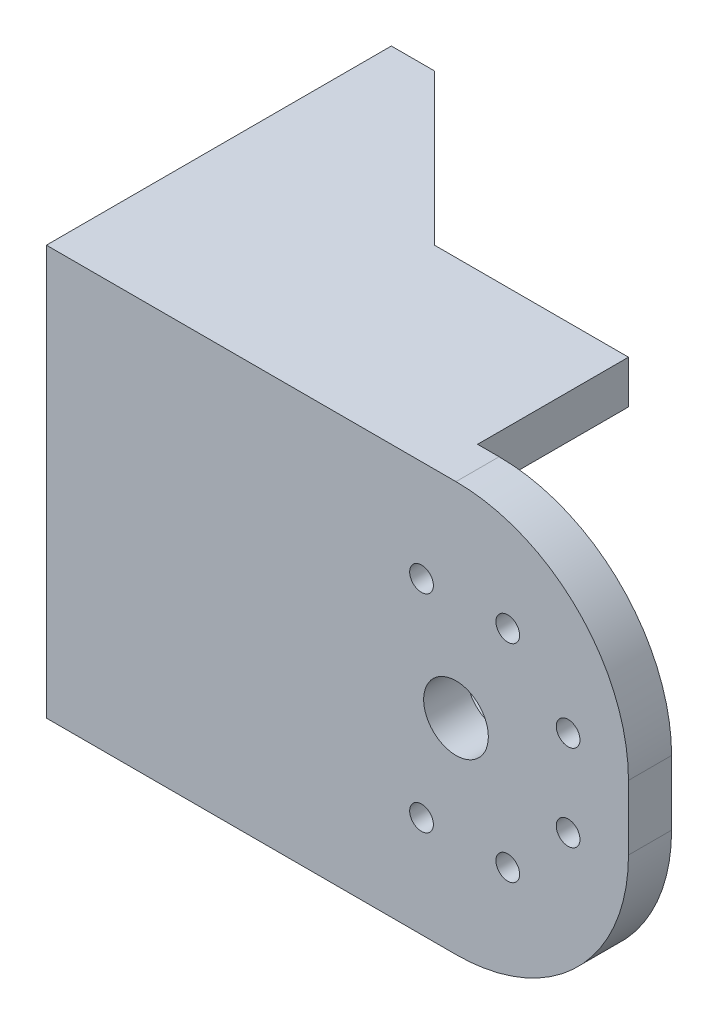
ISO-10303-21;
HEADER;
FILE_DESCRIPTION(('STEP AP214'),'2;1');
FILE_NAME('part.step','',(''),(''),'','','');
FILE_SCHEMA(('AUTOMOTIVE_DESIGN { 1 0 10303 214 1 1 1 1 }'));
ENDSEC;
DATA;
#1=APPLICATION_CONTEXT('core data for automotive mechanical design processes');
#2=APPLICATION_PROTOCOL_DEFINITION('international standard','automotive_design',2000,#1);
#3=PRODUCT_CONTEXT('',#1,'mechanical');
#4=PRODUCT('Part','Part','',(#3));
#5=PRODUCT_RELATED_PRODUCT_CATEGORY('part','',(#4));
#6=PRODUCT_DEFINITION_FORMATION('','',#4);
#7=PRODUCT_DEFINITION_CONTEXT('part definition',#1,'design');
#8=PRODUCT_DEFINITION('design','',#6,#7);
#9=PRODUCT_DEFINITION_SHAPE('','',#8);
#10=(LENGTH_UNIT() NAMED_UNIT(*) SI_UNIT(.MILLI.,.METRE.));
#11=(NAMED_UNIT(*) PLANE_ANGLE_UNIT() SI_UNIT($,.RADIAN.));
#12=(NAMED_UNIT(*) SI_UNIT($,.STERADIAN.) SOLID_ANGLE_UNIT());
#13=UNCERTAINTY_MEASURE_WITH_UNIT(LENGTH_MEASURE(1.E-05),#10,'distance_accuracy_value','');
#14=(GEOMETRIC_REPRESENTATION_CONTEXT(3) GLOBAL_UNCERTAINTY_ASSIGNED_CONTEXT((#13)) GLOBAL_UNIT_ASSIGNED_CONTEXT((#10,
#11,#12)) REPRESENTATION_CONTEXT('',''));
#15=CARTESIAN_POINT('',(0.,0.,0.));
#16=DIRECTION('',(0.,0.,1.));
#17=DIRECTION('',(1.,0.,0.));
#18=AXIS2_PLACEMENT_3D('',#15,#16,#17);
#19=CARTESIAN_POINT('',(163.617133812738,25.0599329401079,0.));
#20=DIRECTION('',(0.,0.,1.));
#21=DIRECTION('',(1.,0.,0.));
#22=AXIS2_PLACEMENT_3D('',#19,#20,#21);
#23=PLANE('',#22);
#24=CARTESIAN_POINT('',(189.617133812738,22.5599329401079,0.));
#25=DIRECTION('',(0.,0.,1.));
#26=DIRECTION('',(1.,0.,0.));
#27=AXIS2_PLACEMENT_3D('',#24,#25,#26);
#28=CIRCLE('',#27,2.75000000000001);
#29=CARTESIAN_POINT('',(192.367133812738,22.5599329401079,0.));
#30=VERTEX_POINT('',#29);
#31=EDGE_CURVE('E214',#30,#30,#28,.T.);
#32=ORIENTED_EDGE('',*,*,#31,.T.);
#33=EDGE_LOOP('',(#32));
#34=FACE_BOUND('',#33,.T.);
#35=CARTESIAN_POINT('',(175.617133812738,8.55993294010792,0.));
#36=DIRECTION('',(0.,0.,1.));
#37=DIRECTION('',(1.,0.,0.));
#38=AXIS2_PLACEMENT_3D('',#35,#36,#37);
#39=CIRCLE('',#38,2.75000000000001);
#40=CARTESIAN_POINT('',(178.367133812738,8.55993294010792,0.));
#41=VERTEX_POINT('',#40);
#42=EDGE_CURVE('E220',#41,#41,#39,.T.);
#43=ORIENTED_EDGE('',*,*,#42,.T.);
#44=EDGE_LOOP('',(#43));
#45=FACE_BOUND('',#44,.T.);
#46=CARTESIAN_POINT('',(155.617133812738,8.55993294010792,0.));
#47=DIRECTION('',(0.,0.,1.));
#48=DIRECTION('',(1.,0.,0.));
#49=AXIS2_PLACEMENT_3D('',#46,#47,#48);
#50=CIRCLE('',#49,2.75000000000001);
#51=CARTESIAN_POINT('',(158.367133812738,8.55993294010792,0.));
#52=VERTEX_POINT('',#51);
#53=EDGE_CURVE('E226',#52,#52,#50,.T.);
#54=ORIENTED_EDGE('',*,*,#53,.T.);
#55=EDGE_LOOP('',(#54));
#56=FACE_BOUND('',#55,.T.);
#57=CARTESIAN_POINT('',(175.617133812738,56.5599329401079,0.));
#58=DIRECTION('',(0.,0.,1.));
#59=DIRECTION('',(1.,0.,0.));
#60=AXIS2_PLACEMENT_3D('',#57,#58,#59);
#61=CIRCLE('',#60,2.75000000000001);
#62=CARTESIAN_POINT('',(178.367133812738,56.5599329401079,0.));
#63=VERTEX_POINT('',#62);
#64=EDGE_CURVE('E232',#63,#63,#61,.T.);
#65=ORIENTED_EDGE('',*,*,#64,.T.);
#66=EDGE_LOOP('',(#65));
#67=FACE_BOUND('',#66,.T.);
#68=CARTESIAN_POINT('',(155.617133812738,56.5599329401079,0.));
#69=DIRECTION('',(0.,0.,1.));
#70=DIRECTION('',(1.,0.,0.));
#71=AXIS2_PLACEMENT_3D('',#68,#69,#70);
#72=CIRCLE('',#71,2.75000000000001);
#73=CARTESIAN_POINT('',(158.367133812738,56.5599329401079,0.));
#74=VERTEX_POINT('',#73);
#75=EDGE_CURVE('E238',#74,#74,#72,.T.);
#76=ORIENTED_EDGE('',*,*,#75,.T.);
#77=EDGE_LOOP('',(#76));
#78=FACE_BOUND('',#77,.T.);
#79=CARTESIAN_POINT('',(189.617133812738,42.5599329401079,0.));
#80=DIRECTION('',(0.,0.,1.));
#81=DIRECTION('',(1.,0.,0.));
#82=AXIS2_PLACEMENT_3D('',#79,#80,#81);
#83=CIRCLE('',#82,2.75000000000001);
#84=CARTESIAN_POINT('',(192.367133812738,42.5599329401079,0.));
#85=VERTEX_POINT('',#84);
#86=EDGE_CURVE('E244',#85,#85,#83,.T.);
#87=ORIENTED_EDGE('',*,*,#86,.T.);
#88=EDGE_LOOP('',(#87));
#89=FACE_BOUND('',#88,.T.);
#90=CARTESIAN_POINT('',(163.617133812738,32.5599329401079,0.));
#91=DIRECTION('',(0.,0.,1.));
#92=DIRECTION('',(1.,0.,0.));
#93=AXIS2_PLACEMENT_3D('',#90,#91,#92);
#94=CIRCLE('',#93,7.50000000000001);
#95=CARTESIAN_POINT('',(171.117133812738,32.5599329401079,0.));
#96=VERTEX_POINT('',#95);
#97=EDGE_CURVE('E250',#96,#96,#94,.T.);
#98=ORIENTED_EDGE('',*,*,#97,.T.);
#99=EDGE_LOOP('',(#98));
#100=FACE_BOUND('',#99,.T.);
#101=DIRECTION('',(1.,0.,0.));
#102=VECTOR('',#101,1.);
#103=CARTESIAN_POINT('',(78.6171338127376,-4.94006705989208,0.));
#104=LINE('',#103,#102);
#105=CARTESIAN_POINT('',(78.6171338127376,-4.94006705989208,0.));
#106=VERTEX_POINT('',#105);
#107=CARTESIAN_POINT('',(158.617133812738,-4.94006705989209,0.));
#108=VERTEX_POINT('',#107);
#109=EDGE_CURVE('E160',#106,#108,#104,.T.);
#110=ORIENTED_EDGE('',*,*,#109,.F.);
#111=DIRECTION('',(0.,-1.,0.));
#112=VECTOR('',#111,1.);
#113=CARTESIAN_POINT('',(78.6171338127376,80.0599329401079,0.));
#114=LINE('',#113,#112);
#115=CARTESIAN_POINT('',(78.6171338127376,70.0599329401079,0.));
#116=VERTEX_POINT('',#115);
#117=EDGE_CURVE('E199',#116,#106,#114,.T.);
#118=ORIENTED_EDGE('',*,*,#117,.F.);
#119=DIRECTION('',(-1.,0.,0.));
#120=VECTOR('',#119,1.);
#121=CARTESIAN_POINT('',(78.6171338127376,70.0599329401079,0.));
#122=LINE('',#121,#120);
#123=CARTESIAN_POINT('',(158.617133812738,70.0599329401079,0.));
#124=VERTEX_POINT('',#123);
#125=EDGE_CURVE('E182',#124,#116,#122,.T.);
#126=ORIENTED_EDGE('',*,*,#125,.F.);
#127=DIRECTION('',(0.,-1.,0.));
#128=VECTOR('',#127,1.);
#129=CARTESIAN_POINT('',(158.617133812738,80.0599329401079,0.));
#130=LINE('',#129,#128);
#131=CARTESIAN_POINT('',(158.617133812738,80.0599329401079,0.));
#132=VERTEX_POINT('',#131);
#133=EDGE_CURVE('E178',#132,#124,#130,.T.);
#134=ORIENTED_EDGE('',*,*,#133,.F.);
#135=DIRECTION('',(-1.,0.,0.));
#136=VECTOR('',#135,1.);
#137=CARTESIAN_POINT('',(68.6171338127376,80.0599329401079,0.));
#138=LINE('',#137,#136);
#139=CARTESIAN_POINT('',(163.617133812738,80.0599329401079,0.));
#140=VERTEX_POINT('',#139);
#141=EDGE_CURVE('E263',#140,#132,#138,.T.);
#142=ORIENTED_EDGE('',*,*,#141,.F.);
#143=CARTESIAN_POINT('',(163.617133812738,40.0599329401079,0.));
#144=DIRECTION('',(0.,0.,1.));
#145=DIRECTION('',(-1.,0.,0.));
#146=AXIS2_PLACEMENT_3D('',#143,#144,#145);
#147=CIRCLE('',#146,40.);
#148=CARTESIAN_POINT('',(203.617133812738,40.0599329401079,0.));
#149=VERTEX_POINT('',#148);
#150=EDGE_CURVE('E279',#149,#140,#147,.T.);
#151=ORIENTED_EDGE('',*,*,#150,.F.);
#152=DIRECTION('',(0.,1.,0.));
#153=VECTOR('',#152,1.);
#154=CARTESIAN_POINT('',(203.617133812738,40.0599329401079,0.));
#155=LINE('',#154,#153);
#156=CARTESIAN_POINT('',(203.617133812738,25.0599329401079,0.));
#157=VERTEX_POINT('',#156);
#158=EDGE_CURVE('E277',#157,#149,#155,.T.);
#159=ORIENTED_EDGE('',*,*,#158,.F.);
#160=CARTESIAN_POINT('',(163.617133812738,25.0599329401079,0.));
#161=DIRECTION('',(0.,0.,1.));
#162=DIRECTION('',(1.,0.,0.));
#163=AXIS2_PLACEMENT_3D('',#160,#161,#162);
#164=CIRCLE('',#163,40.);
#165=CARTESIAN_POINT('',(163.617133812738,-14.9400670598921,0.));
#166=VERTEX_POINT('',#165);
#167=EDGE_CURVE('E275',#166,#157,#164,.T.);
#168=ORIENTED_EDGE('',*,*,#167,.F.);
#169=DIRECTION('',(1.,0.,0.));
#170=VECTOR('',#169,1.);
#171=CARTESIAN_POINT('',(68.6171338127376,-14.9400670598921,0.));
#172=LINE('',#171,#170);
#173=CARTESIAN_POINT('',(158.617133812738,-14.9400670598921,0.));
#174=VERTEX_POINT('',#173);
#175=EDGE_CURVE('E256',#174,#166,#172,.T.);
#176=ORIENTED_EDGE('',*,*,#175,.F.);
#177=DIRECTION('',(0.,-1.,0.));
#178=VECTOR('',#177,1.);
#179=CARTESIAN_POINT('',(158.617133812738,-14.9400670598921,0.));
#180=LINE('',#179,#178);
#181=EDGE_CURVE('E154',#108,#174,#180,.T.);
#182=ORIENTED_EDGE('',*,*,#181,.F.);
#183=EDGE_LOOP('',(#110,#118,#126,#134,#142,#151,#159,#168,#176,#182));
#184=FACE_BOUND('',#183,.T.);
#185=ADVANCED_FACE('F38',(#34,#45,#56,#67,#78,#89,#100,#184),#23,.F.);
#186=CARTESIAN_POINT('',(78.6171338127376,80.0599329401079,-70.));
#187=DIRECTION('',(-1.,0.,0.));
#188=DIRECTION('',(0.,-1.,0.));
#189=AXIS2_PLACEMENT_3D('',#186,#187,#188);
#190=PLANE('',#189);
#191=CARTESIAN_POINT('',(78.6171338127376,25.862972873719,-56.1678918189476));
#192=DIRECTION('',(-1.,0.,0.));
#193=DIRECTION('',(0.,-1.,0.));
#194=AXIS2_PLACEMENT_3D('',#191,#192,#193);
#195=CIRCLE('',#194,2.75);
#196=CARTESIAN_POINT('',(78.6171338127376,23.112972873719,-56.1678918189476));
#197=VERTEX_POINT('',#196);
#198=EDGE_CURVE('E174',#197,#197,#195,.T.);
#199=ORIENTED_EDGE('',*,*,#198,.T.);
#200=EDGE_LOOP('',(#199));
#201=FACE_BOUND('',#200,.T.);
#202=CARTESIAN_POINT('',(78.6171338127376,39.2568930064971,-56.1678918189475));
#203=DIRECTION('',(-1.,0.,0.));
#204=DIRECTION('',(0.,-1.,0.));
#205=AXIS2_PLACEMENT_3D('',#202,#203,#204);
#206=CIRCLE('',#205,2.75);
#207=CARTESIAN_POINT('',(78.6171338127376,36.5068930064971,-56.1678918189475));
#208=VERTEX_POINT('',#207);
#209=EDGE_CURVE('E769',#208,#208,#206,.T.);
#210=ORIENTED_EDGE('',*,*,#209,.T.);
#211=EDGE_LOOP('',(#210));
#212=FACE_BOUND('',#211,.T.);
#213=CARTESIAN_POINT('',(78.6171338127376,48.7278247590555,-46.696960066389));
#214=DIRECTION('',(-1.,0.,0.));
#215=DIRECTION('',(0.,-1.,0.));
#216=AXIS2_PLACEMENT_3D('',#213,#214,#215);
#217=CIRCLE('',#216,2.75);
#218=CARTESIAN_POINT('',(78.6171338127376,45.9778247590555,-46.696960066389));
#219=VERTEX_POINT('',#218);
#220=EDGE_CURVE('E766',#219,#219,#217,.T.);
#221=ORIENTED_EDGE('',*,*,#220,.T.);
#222=EDGE_LOOP('',(#221));
#223=FACE_BOUND('',#222,.T.);
#224=CARTESIAN_POINT('',(78.6171338127376,48.7278247590554,-33.3030399336108));
#225=DIRECTION('',(-1.,0.,0.));
#226=DIRECTION('',(0.,-1.,0.));
#227=AXIS2_PLACEMENT_3D('',#224,#225,#226);
#228=CIRCLE('',#227,2.75);
#229=CARTESIAN_POINT('',(78.6171338127376,45.9778247590554,-33.3030399336108));
#230=VERTEX_POINT('',#229);
#231=EDGE_CURVE('E763',#230,#230,#228,.T.);
#232=ORIENTED_EDGE('',*,*,#231,.T.);
#233=EDGE_LOOP('',(#232));
#234=FACE_BOUND('',#233,.T.);
#235=CARTESIAN_POINT('',(78.6171338127376,39.2568930064969,-23.8321081810524));
#236=DIRECTION('',(-1.,0.,0.));
#237=DIRECTION('',(0.,-1.,0.));
#238=AXIS2_PLACEMENT_3D('',#235,#236,#237);
#239=CIRCLE('',#238,2.75);
#240=CARTESIAN_POINT('',(78.6171338127376,36.5068930064969,-23.8321081810524));
#241=VERTEX_POINT('',#240);
#242=EDGE_CURVE('E760',#241,#241,#239,.T.);
#243=ORIENTED_EDGE('',*,*,#242,.T.);
#244=EDGE_LOOP('',(#243));
#245=FACE_BOUND('',#244,.T.);
#246=CARTESIAN_POINT('',(78.6171338127376,25.8629728737188,-23.8321081810525));
#247=DIRECTION('',(-1.,0.,0.));
#248=DIRECTION('',(0.,-1.,0.));
#249=AXIS2_PLACEMENT_3D('',#246,#247,#248);
#250=CIRCLE('',#249,2.75);
#251=CARTESIAN_POINT('',(78.6171338127376,23.1129728737188,-23.8321081810525));
#252=VERTEX_POINT('',#251);
#253=EDGE_CURVE('E757',#252,#252,#250,.T.);
#254=ORIENTED_EDGE('',*,*,#253,.T.);
#255=EDGE_LOOP('',(#254));
#256=FACE_BOUND('',#255,.T.);
#257=CARTESIAN_POINT('',(78.6171338127376,16.3920411211604,-33.303039933611));
#258=DIRECTION('',(-1.,0.,0.));
#259=DIRECTION('',(0.,-1.,0.));
#260=AXIS2_PLACEMENT_3D('',#257,#258,#259);
#261=CIRCLE('',#260,2.75);
#262=CARTESIAN_POINT('',(78.6171338127376,13.6420411211604,-33.303039933611));
#263=VERTEX_POINT('',#262);
#264=EDGE_CURVE('E750',#263,#263,#261,.T.);
#265=ORIENTED_EDGE('',*,*,#264,.T.);
#266=EDGE_LOOP('',(#265));
#267=FACE_BOUND('',#266,.T.);
#268=CARTESIAN_POINT('',(78.6171338127376,16.3920411211605,-46.6969600663892));
#269=DIRECTION('',(-1.,0.,0.));
#270=DIRECTION('',(0.,-1.,0.));
#271=AXIS2_PLACEMENT_3D('',#268,#269,#270);
#272=CIRCLE('',#271,2.75);
#273=CARTESIAN_POINT('',(78.6171338127376,13.6420411211605,-46.6969600663892));
#274=VERTEX_POINT('',#273);
#275=EDGE_CURVE('E747',#274,#274,#272,.T.);
#276=ORIENTED_EDGE('',*,*,#275,.T.);
#277=EDGE_LOOP('',(#276));
#278=FACE_BOUND('',#277,.T.);
#279=CARTESIAN_POINT('',(78.6171338127376,32.5599329401079,-40.));
#280=DIRECTION('',(-1.,0.,0.));
#281=DIRECTION('',(0.,-1.,0.));
#282=AXIS2_PLACEMENT_3D('',#279,#280,#281);
#283=CIRCLE('',#282,7.5);
#284=CARTESIAN_POINT('',(78.6171338127376,25.0599329401079,-40.));
#285=VERTEX_POINT('',#284);
#286=EDGE_CURVE('E745',#285,#285,#283,.T.);
#287=ORIENTED_EDGE('',*,*,#286,.T.);
#288=EDGE_LOOP('',(#287));
#289=FACE_BOUND('',#288,.T.);
#290=DIRECTION('',(0.,-1.,0.));
#291=VECTOR('',#290,1.);
#292=CARTESIAN_POINT('',(78.6171338127376,80.0599329401079,-70.));
#293=LINE('',#292,#291);
#294=CARTESIAN_POINT('',(78.6171338127376,70.0599329401079,-70.));
#295=VERTEX_POINT('',#294);
#296=CARTESIAN_POINT('',(78.6171338127376,-4.94006705989207,-70.));
#297=VERTEX_POINT('',#296);
#298=EDGE_CURVE('E211',#295,#297,#293,.T.);
#299=ORIENTED_EDGE('',*,*,#298,.F.);
#300=DIRECTION('',(0.,0.,1.));
#301=VECTOR('',#300,1.);
#302=CARTESIAN_POINT('',(78.6171338127376,70.0599329401079,-35.));
#303=LINE('',#302,#301);
#304=EDGE_CURVE('E187',#295,#116,#303,.T.);
#305=ORIENTED_EDGE('',*,*,#304,.T.);
#306=ORIENTED_EDGE('',*,*,#117,.T.);
#307=DIRECTION('',(0.,0.,1.));
#308=VECTOR('',#307,1.);
#309=CARTESIAN_POINT('',(78.6171338127376,-4.94006705989208,-35.));
#310=LINE('',#309,#308);
#311=EDGE_CURVE('E164',#297,#106,#310,.T.);
#312=ORIENTED_EDGE('',*,*,#311,.F.);
#313=EDGE_LOOP('',(#299,#305,#306,#312));
#314=FACE_BOUND('',#313,.T.);
#315=ADVANCED_FACE('F320',(#201,#212,#223,#234,#245,#256,#267,#278,#289,#314),#190,.F.);
#316=CARTESIAN_POINT('',(163.617133812738,25.0599329401079,10.));
#317=DIRECTION('',(0.,0.,1.));
#318=DIRECTION('',(1.,0.,0.));
#319=AXIS2_PLACEMENT_3D('',#316,#317,#318);
#320=PLANE('',#319);
#321=CARTESIAN_POINT('',(175.617133812738,8.55993294010792,10.));
#322=DIRECTION('',(0.,0.,1.));
#323=DIRECTION('',(1.,0.,0.));
#324=AXIS2_PLACEMENT_3D('',#321,#322,#323);
#325=CIRCLE('',#324,2.75000000000001);
#326=CARTESIAN_POINT('',(178.367133812738,8.55993294010792,10.));
#327=VERTEX_POINT('',#326);
#328=EDGE_CURVE('E223',#327,#327,#325,.T.);
#329=ORIENTED_EDGE('',*,*,#328,.F.);
#330=EDGE_LOOP('',(#329));
#331=FACE_BOUND('',#330,.T.);
#332=CARTESIAN_POINT('',(175.617133812738,56.5599329401079,10.));
#333=DIRECTION('',(0.,0.,1.));
#334=DIRECTION('',(1.,0.,0.));
#335=AXIS2_PLACEMENT_3D('',#332,#333,#334);
#336=CIRCLE('',#335,2.75000000000001);
#337=CARTESIAN_POINT('',(178.367133812738,56.5599329401079,10.));
#338=VERTEX_POINT('',#337);
#339=EDGE_CURVE('E235',#338,#338,#336,.T.);
#340=ORIENTED_EDGE('',*,*,#339,.F.);
#341=EDGE_LOOP('',(#340));
#342=FACE_BOUND('',#341,.T.);
#343=CARTESIAN_POINT('',(189.617133812738,42.5599329401079,10.));
#344=DIRECTION('',(0.,0.,1.));
#345=DIRECTION('',(1.,0.,0.));
#346=AXIS2_PLACEMENT_3D('',#343,#344,#345);
#347=CIRCLE('',#346,2.75000000000001);
#348=CARTESIAN_POINT('',(192.367133812738,42.5599329401079,10.));
#349=VERTEX_POINT('',#348);
#350=EDGE_CURVE('E247',#349,#349,#347,.T.);
#351=ORIENTED_EDGE('',*,*,#350,.F.);
#352=EDGE_LOOP('',(#351));
#353=FACE_BOUND('',#352,.T.);
#354=DIRECTION('',(0.,-1.,0.));
#355=VECTOR('',#354,1.);
#356=CARTESIAN_POINT('',(68.6171338127376,80.0599329401079,10.));
#357=LINE('',#356,#355);
#358=CARTESIAN_POINT('',(68.6171338127376,80.0599329401079,10.));
#359=VERTEX_POINT('',#358);
#360=CARTESIAN_POINT('',(68.6171338127376,-14.9400670598921,10.));
#361=VERTEX_POINT('',#360);
#362=EDGE_CURVE('E259',#359,#361,#357,.T.);
#363=ORIENTED_EDGE('',*,*,#362,.T.);
#364=DIRECTION('',(1.,0.,0.));
#365=VECTOR('',#364,1.);
#366=CARTESIAN_POINT('',(68.6171338127376,-14.9400670598921,10.));
#367=LINE('',#366,#365);
#368=CARTESIAN_POINT('',(163.617133812738,-14.9400670598921,10.));
#369=VERTEX_POINT('',#368);
#370=EDGE_CURVE('E262',#361,#369,#367,.T.);
#371=ORIENTED_EDGE('',*,*,#370,.T.);
#372=CARTESIAN_POINT('',(163.617133812738,25.0599329401079,10.));
#373=DIRECTION('',(0.,0.,1.));
#374=DIRECTION('',(1.,0.,0.));
#375=AXIS2_PLACEMENT_3D('',#372,#373,#374);
#376=CIRCLE('',#375,40.);
#377=CARTESIAN_POINT('',(203.617133812738,25.0599329401079,10.));
#378=VERTEX_POINT('',#377);
#379=EDGE_CURVE('E265',#369,#378,#376,.T.);
#380=ORIENTED_EDGE('',*,*,#379,.T.);
#381=DIRECTION('',(0.,1.,0.));
#382=VECTOR('',#381,1.);
#383=CARTESIAN_POINT('',(203.617133812738,40.0599329401079,10.));
#384=LINE('',#383,#382);
#385=CARTESIAN_POINT('',(203.617133812738,40.0599329401079,10.));
#386=VERTEX_POINT('',#385);
#387=EDGE_CURVE('E267',#378,#386,#384,.T.);
#388=ORIENTED_EDGE('',*,*,#387,.T.);
#389=CARTESIAN_POINT('',(163.617133812738,40.0599329401079,10.));
#390=DIRECTION('',(0.,0.,1.));
#391=DIRECTION('',(-1.,0.,0.));
#392=AXIS2_PLACEMENT_3D('',#389,#390,#391);
#393=CIRCLE('',#392,40.);
#394=CARTESIAN_POINT('',(163.617133812738,80.0599329401079,10.));
#395=VERTEX_POINT('',#394);
#396=EDGE_CURVE('E269',#386,#395,#393,.T.);
#397=ORIENTED_EDGE('',*,*,#396,.T.);
#398=DIRECTION('',(-1.,0.,0.));
#399=VECTOR('',#398,1.);
#400=CARTESIAN_POINT('',(68.6171338127376,80.0599329401079,10.));
#401=LINE('',#400,#399);
#402=EDGE_CURVE('E271',#395,#359,#401,.T.);
#403=ORIENTED_EDGE('',*,*,#402,.T.);
#404=EDGE_LOOP('',(#363,#371,#380,#388,#397,#403));
#405=FACE_BOUND('',#404,.T.);
#406=CARTESIAN_POINT('',(163.617133812738,32.5599329401079,10.));
#407=DIRECTION('',(0.,0.,1.));
#408=DIRECTION('',(1.,0.,0.));
#409=AXIS2_PLACEMENT_3D('',#406,#407,#408);
#410=CIRCLE('',#409,7.50000000000001);
#411=CARTESIAN_POINT('',(171.117133812738,32.5599329401079,10.));
#412=VERTEX_POINT('',#411);
#413=EDGE_CURVE('E253',#412,#412,#410,.T.);
#414=ORIENTED_EDGE('',*,*,#413,.F.);
#415=EDGE_LOOP('',(#414));
#416=FACE_BOUND('',#415,.T.);
#417=CARTESIAN_POINT('',(155.617133812738,56.5599329401079,10.));
#418=DIRECTION('',(0.,0.,1.));
#419=DIRECTION('',(1.,0.,0.));
#420=AXIS2_PLACEMENT_3D('',#417,#418,#419);
#421=CIRCLE('',#420,2.75000000000001);
#422=CARTESIAN_POINT('',(158.367133812738,56.5599329401079,10.));
#423=VERTEX_POINT('',#422);
#424=EDGE_CURVE('E241',#423,#423,#421,.T.);
#425=ORIENTED_EDGE('',*,*,#424,.F.);
#426=EDGE_LOOP('',(#425));
#427=FACE_BOUND('',#426,.T.);
#428=CARTESIAN_POINT('',(155.617133812738,8.55993294010792,10.));
#429=DIRECTION('',(0.,0.,1.));
#430=DIRECTION('',(1.,0.,0.));
#431=AXIS2_PLACEMENT_3D('',#428,#429,#430);
#432=CIRCLE('',#431,2.75000000000001);
#433=CARTESIAN_POINT('',(158.367133812738,8.55993294010792,10.));
#434=VERTEX_POINT('',#433);
#435=EDGE_CURVE('E229',#434,#434,#432,.T.);
#436=ORIENTED_EDGE('',*,*,#435,.F.);
#437=EDGE_LOOP('',(#436));
#438=FACE_BOUND('',#437,.T.);
#439=CARTESIAN_POINT('',(189.617133812738,22.5599329401079,10.));
#440=DIRECTION('',(0.,0.,1.));
#441=DIRECTION('',(1.,0.,0.));
#442=AXIS2_PLACEMENT_3D('',#439,#440,#441);
#443=CIRCLE('',#442,2.75000000000001);
#444=CARTESIAN_POINT('',(192.367133812738,22.5599329401079,10.));
#445=VERTEX_POINT('',#444);
#446=EDGE_CURVE('E217',#445,#445,#443,.T.);
#447=ORIENTED_EDGE('',*,*,#446,.F.);
#448=EDGE_LOOP('',(#447));
#449=FACE_BOUND('',#448,.T.);
#450=ADVANCED_FACE('F326',(#331,#342,#353,#405,#416,#427,#438,#449),#320,.T.);
#451=CARTESIAN_POINT('',(68.6171338127376,80.0599329401079,10.));
#452=DIRECTION('',(1.,0.,0.));
#453=DIRECTION('',(0.,1.,0.));
#454=AXIS2_PLACEMENT_3D('',#451,#452,#453);
#455=PLANE('',#454);
#456=CARTESIAN_POINT('',(68.6171338127376,25.862972873719,-56.1678918189476));
#457=DIRECTION('',(-1.,0.,0.));
#458=DIRECTION('',(0.,-1.,0.));
#459=AXIS2_PLACEMENT_3D('',#456,#457,#458);
#460=CIRCLE('',#459,2.75);
#461=CARTESIAN_POINT('',(68.6171338127376,23.112972873719,-56.1678918189476));
#462=VERTEX_POINT('',#461);
#463=EDGE_CURVE('E368',#462,#462,#460,.T.);
#464=ORIENTED_EDGE('',*,*,#463,.F.);
#465=EDGE_LOOP('',(#464));
#466=FACE_BOUND('',#465,.T.);
#467=CARTESIAN_POINT('',(68.6171338127376,39.2568930064971,-56.1678918189475));
#468=DIRECTION('',(-1.,0.,0.));
#469=DIRECTION('',(0.,-1.,0.));
#470=AXIS2_PLACEMENT_3D('',#467,#468,#469);
#471=CIRCLE('',#470,2.75);
#472=CARTESIAN_POINT('',(68.6171338127376,36.5068930064971,-56.1678918189475));
#473=VERTEX_POINT('',#472);
#474=EDGE_CURVE('E372',#473,#473,#471,.T.);
#475=ORIENTED_EDGE('',*,*,#474,.F.);
#476=EDGE_LOOP('',(#475));
#477=FACE_BOUND('',#476,.T.);
#478=CARTESIAN_POINT('',(68.6171338127376,48.7278247590555,-46.696960066389));
#479=DIRECTION('',(-1.,0.,0.));
#480=DIRECTION('',(0.,-1.,0.));
#481=AXIS2_PLACEMENT_3D('',#478,#479,#480);
#482=CIRCLE('',#481,2.75);
#483=CARTESIAN_POINT('',(68.6171338127376,45.9778247590555,-46.696960066389));
#484=VERTEX_POINT('',#483);
#485=EDGE_CURVE('E376',#484,#484,#482,.T.);
#486=ORIENTED_EDGE('',*,*,#485,.F.);
#487=EDGE_LOOP('',(#486));
#488=FACE_BOUND('',#487,.T.);
#489=CARTESIAN_POINT('',(68.6171338127376,48.7278247590554,-33.3030399336108));
#490=DIRECTION('',(-1.,0.,0.));
#491=DIRECTION('',(0.,-1.,0.));
#492=AXIS2_PLACEMENT_3D('',#489,#490,#491);
#493=CIRCLE('',#492,2.75);
#494=CARTESIAN_POINT('',(68.6171338127376,45.9778247590554,-33.3030399336108));
#495=VERTEX_POINT('',#494);
#496=EDGE_CURVE('E380',#495,#495,#493,.T.);
#497=ORIENTED_EDGE('',*,*,#496,.F.);
#498=EDGE_LOOP('',(#497));
#499=FACE_BOUND('',#498,.T.);
#500=CARTESIAN_POINT('',(68.6171338127376,39.2568930064969,-23.8321081810524));
#501=DIRECTION('',(-1.,0.,0.));
#502=DIRECTION('',(0.,-1.,0.));
#503=AXIS2_PLACEMENT_3D('',#500,#501,#502);
#504=CIRCLE('',#503,2.75);
#505=CARTESIAN_POINT('',(68.6171338127376,36.5068930064969,-23.8321081810524));
#506=VERTEX_POINT('',#505);
#507=EDGE_CURVE('E384',#506,#506,#504,.T.);
#508=ORIENTED_EDGE('',*,*,#507,.F.);
#509=EDGE_LOOP('',(#508));
#510=FACE_BOUND('',#509,.T.);
#511=CARTESIAN_POINT('',(68.6171338127376,25.8629728737188,-23.8321081810525));
#512=DIRECTION('',(-1.,0.,0.));
#513=DIRECTION('',(0.,-1.,0.));
#514=AXIS2_PLACEMENT_3D('',#511,#512,#513);
#515=CIRCLE('',#514,2.75);
#516=CARTESIAN_POINT('',(68.6171338127376,23.1129728737188,-23.8321081810525));
#517=VERTEX_POINT('',#516);
#518=EDGE_CURVE('E388',#517,#517,#515,.T.);
#519=ORIENTED_EDGE('',*,*,#518,.F.);
#520=EDGE_LOOP('',(#519));
#521=FACE_BOUND('',#520,.T.);
#522=CARTESIAN_POINT('',(68.6171338127376,16.3920411211604,-33.303039933611));
#523=DIRECTION('',(-1.,0.,0.));
#524=DIRECTION('',(0.,-1.,0.));
#525=AXIS2_PLACEMENT_3D('',#522,#523,#524);
#526=CIRCLE('',#525,2.75);
#527=CARTESIAN_POINT('',(68.6171338127376,13.6420411211604,-33.303039933611));
#528=VERTEX_POINT('',#527);
#529=EDGE_CURVE('E392',#528,#528,#526,.T.);
#530=ORIENTED_EDGE('',*,*,#529,.F.);
#531=EDGE_LOOP('',(#530));
#532=FACE_BOUND('',#531,.T.);
#533=CARTESIAN_POINT('',(68.6171338127376,16.3920411211605,-46.6969600663892));
#534=DIRECTION('',(-1.,0.,0.));
#535=DIRECTION('',(0.,-1.,0.));
#536=AXIS2_PLACEMENT_3D('',#533,#534,#535);
#537=CIRCLE('',#536,2.75);
#538=CARTESIAN_POINT('',(68.6171338127376,13.6420411211604,-46.6969600663892));
#539=VERTEX_POINT('',#538);
#540=EDGE_CURVE('E396',#539,#539,#537,.T.);
#541=ORIENTED_EDGE('',*,*,#540,.F.);
#542=EDGE_LOOP('',(#541));
#543=FACE_BOUND('',#542,.T.);
#544=CARTESIAN_POINT('',(68.6171338127376,32.5599329401079,-40.));
#545=DIRECTION('',(-1.,0.,0.));
#546=DIRECTION('',(0.,-1.,0.));
#547=AXIS2_PLACEMENT_3D('',#544,#545,#546);
#548=CIRCLE('',#547,7.5);
#549=CARTESIAN_POINT('',(68.6171338127376,25.0599329401079,-40.));
#550=VERTEX_POINT('',#549);
#551=EDGE_CURVE('E400',#550,#550,#548,.T.);
#552=ORIENTED_EDGE('',*,*,#551,.F.);
#553=EDGE_LOOP('',(#552));
#554=FACE_BOUND('',#553,.T.);
#555=DIRECTION('',(0.,0.,-1.));
#556=VECTOR('',#555,1.);
#557=CARTESIAN_POINT('',(68.6171338127376,80.0599329401079,10.));
#558=LINE('',#557,#556);
#559=CARTESIAN_POINT('',(68.6171338127376,80.0599329401079,-70.));
#560=VERTEX_POINT('',#559);
#561=EDGE_CURVE('E273',#359,#560,#558,.T.);
#562=ORIENTED_EDGE('',*,*,#561,.T.);
#563=DIRECTION('',(0.,1.,0.));
#564=VECTOR('',#563,1.);
#565=CARTESIAN_POINT('',(68.6171338127376,80.0599329401079,-70.));
#566=LINE('',#565,#564);
#567=CARTESIAN_POINT('',(68.6171338127376,-14.9400670598921,-70.));
#568=VERTEX_POINT('',#567);
#569=EDGE_CURVE('E200',#568,#560,#566,.T.);
#570=ORIENTED_EDGE('',*,*,#569,.F.);
#571=DIRECTION('',(0.,0.,-1.));
#572=VECTOR('',#571,1.);
#573=CARTESIAN_POINT('',(68.6171338127376,-14.9400670598921,10.));
#574=LINE('',#573,#572);
#575=EDGE_CURVE('E296',#361,#568,#574,.T.);
#576=ORIENTED_EDGE('',*,*,#575,.F.);
#577=ORIENTED_EDGE('',*,*,#362,.F.);
#578=EDGE_LOOP('',(#562,#570,#576,#577));
#579=FACE_BOUND('',#578,.T.);
#580=ADVANCED_FACE('F353',(#466,#477,#488,#499,#510,#521,#532,#543,#554,#579),#455,.F.);
#581=CARTESIAN_POINT('',(68.6171338127376,-14.9400670598921,10.));
#582=DIRECTION('',(0.,1.,0.));
#583=DIRECTION('',(0.,0.,1.));
#584=AXIS2_PLACEMENT_3D('',#581,#582,#583);
#585=PLANE('',#584);
#586=ORIENTED_EDGE('',*,*,#575,.T.);
#587=DIRECTION('',(-1.,0.,0.));
#588=VECTOR('',#587,1.);
#589=CARTESIAN_POINT('',(68.6171338127376,-14.9400670598921,-70.));
#590=LINE('',#589,#588);
#591=CARTESIAN_POINT('',(78.6171338127376,-14.9400670598921,-70.));
#592=VERTEX_POINT('',#591);
#593=EDGE_CURVE('E210',#592,#568,#590,.T.);
#594=ORIENTED_EDGE('',*,*,#593,.F.);
#595=DIRECTION('',(0.70710678118655,0.,0.707106781186545));
#596=VECTOR('',#595,1.);
#597=CARTESIAN_POINT('',(113.617133812738,-14.9400670598921,-35.0000000000003));
#598=LINE('',#597,#596);
#599=CARTESIAN_POINT('',(113.617133812738,-14.9400670598921,-35.));
#600=VERTEX_POINT('',#599);
#601=EDGE_CURVE('E11',#592,#600,#598,.T.);
#602=ORIENTED_EDGE('',*,*,#601,.T.);
#603=DIRECTION('',(-1.,0.,0.));
#604=VECTOR('',#603,1.);
#605=CARTESIAN_POINT('',(78.6171338127376,-14.9400670598921,-35.));
#606=LINE('',#605,#604);
#607=CARTESIAN_POINT('',(158.617133812738,-14.9400670598921,-35.));
#608=VERTEX_POINT('',#607);
#609=EDGE_CURVE('E168',#608,#600,#606,.T.);
#610=ORIENTED_EDGE('',*,*,#609,.F.);
#611=DIRECTION('',(0.,0.,1.));
#612=VECTOR('',#611,1.);
#613=CARTESIAN_POINT('',(158.617133812738,-14.9400670598921,-35.));
#614=LINE('',#613,#612);
#615=EDGE_CURVE('E165',#608,#174,#614,.T.);
#616=ORIENTED_EDGE('',*,*,#615,.T.);
#617=ORIENTED_EDGE('',*,*,#175,.T.);
#618=DIRECTION('',(0.,0.,-1.));
#619=VECTOR('',#618,1.);
#620=CARTESIAN_POINT('',(163.617133812738,-14.9400670598921,10.));
#621=LINE('',#620,#619);
#622=EDGE_CURVE('E293',#369,#166,#621,.T.);
#623=ORIENTED_EDGE('',*,*,#622,.F.);
#624=ORIENTED_EDGE('',*,*,#370,.F.);
#625=EDGE_LOOP('',(#586,#594,#602,#610,#616,#617,#623,#624));
#626=FACE_BOUND('',#625,.T.);
#627=ADVANCED_FACE('F349',(#626),#585,.F.);
#628=CARTESIAN_POINT('',(163.617133812738,25.0599329401079,10.));
#629=DIRECTION('',(0.,0.,-1.));
#630=DIRECTION('',(-1.,0.,0.));
#631=AXIS2_PLACEMENT_3D('',#628,#629,#630);
#632=CYLINDRICAL_SURFACE('',#631,40.);
#633=ORIENTED_EDGE('',*,*,#167,.T.);
#634=DIRECTION('',(0.,0.,-1.));
#635=VECTOR('',#634,1.);
#636=CARTESIAN_POINT('',(203.617133812738,25.0599329401079,10.));
#637=LINE('',#636,#635);
#638=EDGE_CURVE('E290',#378,#157,#637,.T.);
#639=ORIENTED_EDGE('',*,*,#638,.F.);
#640=ORIENTED_EDGE('',*,*,#379,.F.);
#641=ORIENTED_EDGE('',*,*,#622,.T.);
#642=EDGE_LOOP('',(#633,#639,#640,#641));
#643=FACE_BOUND('',#642,.T.);
#644=ADVANCED_FACE('F345',(#643),#632,.T.);
#645=CARTESIAN_POINT('',(203.617133812738,40.0599329401079,10.));
#646=DIRECTION('',(-1.,0.,0.));
#647=DIRECTION('',(0.,0.,1.));
#648=AXIS2_PLACEMENT_3D('',#645,#646,#647);
#649=PLANE('',#648);
#650=ORIENTED_EDGE('',*,*,#158,.T.);
#651=DIRECTION('',(0.,0.,-1.));
#652=VECTOR('',#651,1.);
#653=CARTESIAN_POINT('',(203.617133812738,40.0599329401079,10.));
#654=LINE('',#653,#652);
#655=EDGE_CURVE('E287',#386,#149,#654,.T.);
#656=ORIENTED_EDGE('',*,*,#655,.F.);
#657=ORIENTED_EDGE('',*,*,#387,.F.);
#658=ORIENTED_EDGE('',*,*,#638,.T.);
#659=EDGE_LOOP('',(#650,#656,#657,#658));
#660=FACE_BOUND('',#659,.T.);
#661=ADVANCED_FACE('F341',(#660),#649,.F.);
#662=CARTESIAN_POINT('',(163.617133812738,40.0599329401079,10.));
#663=DIRECTION('',(0.,0.,-1.));
#664=DIRECTION('',(-1.,0.,0.));
#665=AXIS2_PLACEMENT_3D('',#662,#663,#664);
#666=CYLINDRICAL_SURFACE('',#665,40.);
#667=ORIENTED_EDGE('',*,*,#150,.T.);
#668=DIRECTION('',(0.,0.,-1.));
#669=VECTOR('',#668,1.);
#670=CARTESIAN_POINT('',(163.617133812738,80.0599329401079,10.));
#671=LINE('',#670,#669);
#672=EDGE_CURVE('E284',#395,#140,#671,.T.);
#673=ORIENTED_EDGE('',*,*,#672,.F.);
#674=ORIENTED_EDGE('',*,*,#396,.F.);
#675=ORIENTED_EDGE('',*,*,#655,.T.);
#676=EDGE_LOOP('',(#667,#673,#674,#675));
#677=FACE_BOUND('',#676,.T.);
#678=ADVANCED_FACE('F337',(#677),#666,.T.);
#679=CARTESIAN_POINT('',(68.6171338127376,80.0599329401079,10.));
#680=DIRECTION('',(0.,-1.,0.));
#681=DIRECTION('',(1.,0.,0.));
#682=AXIS2_PLACEMENT_3D('',#679,#680,#681);
#683=PLANE('',#682);
#684=ORIENTED_EDGE('',*,*,#141,.T.);
#685=DIRECTION('',(0.,0.,1.));
#686=VECTOR('',#685,1.);
#687=CARTESIAN_POINT('',(158.617133812738,80.0599329401079,-35.));
#688=LINE('',#687,#686);
#689=CARTESIAN_POINT('',(158.617133812738,80.0599329401079,-35.));
#690=VERTEX_POINT('',#689);
#691=EDGE_CURVE('E196',#690,#132,#688,.T.);
#692=ORIENTED_EDGE('',*,*,#691,.F.);
#693=DIRECTION('',(1.,0.,0.));
#694=VECTOR('',#693,1.);
#695=CARTESIAN_POINT('',(78.6171338127376,80.0599329401079,-35.));
#696=LINE('',#695,#694);
#697=CARTESIAN_POINT('',(113.617133812738,80.0599329401079,-35.));
#698=VERTEX_POINT('',#697);
#699=EDGE_CURVE('E179',#698,#690,#696,.T.);
#700=ORIENTED_EDGE('',*,*,#699,.F.);
#701=DIRECTION('',(0.70710678118655,0.,0.707106781186545));
#702=VECTOR('',#701,1.);
#703=CARTESIAN_POINT('',(113.617133812738,80.0599329401079,-35.0000000000003));
#704=LINE('',#703,#702);
#705=CARTESIAN_POINT('',(78.6171338127376,80.0599329401079,-70.));
#706=VERTEX_POINT('',#705);
#707=EDGE_CURVE('E302',#698,#706,#704,.F.);
#708=ORIENTED_EDGE('',*,*,#707,.T.);
#709=DIRECTION('',(1.,0.,0.));
#710=VECTOR('',#709,1.);
#711=CARTESIAN_POINT('',(68.6171338127376,80.0599329401079,-70.));
#712=LINE('',#711,#710);
#713=EDGE_CURVE('E203',#560,#706,#712,.T.);
#714=ORIENTED_EDGE('',*,*,#713,.F.);
#715=ORIENTED_EDGE('',*,*,#561,.F.);
#716=ORIENTED_EDGE('',*,*,#402,.F.);
#717=ORIENTED_EDGE('',*,*,#672,.T.);
#718=EDGE_LOOP('',(#684,#692,#700,#708,#714,#715,#716,#717));
#719=FACE_BOUND('',#718,.T.);
#720=ADVANCED_FACE('F333',(#719),#683,.F.);
#721=CARTESIAN_POINT('',(163.617133812738,32.5599329401079,10.));
#722=DIRECTION('',(0.,0.,-1.));
#723=DIRECTION('',(-1.,0.,0.));
#724=AXIS2_PLACEMENT_3D('',#721,#722,#723);
#725=CYLINDRICAL_SURFACE('',#724,7.50000000000001);
#726=ORIENTED_EDGE('',*,*,#413,.T.);
#727=EDGE_LOOP('',(#726));
#728=FACE_BOUND('',#727,.T.);
#729=ORIENTED_EDGE('',*,*,#97,.F.);
#730=EDGE_LOOP('',(#729));
#731=FACE_BOUND('',#730,.T.);
#732=ADVANCED_FACE('F336',(#728,#731),#725,.F.);
#733=CARTESIAN_POINT('',(189.617133812738,42.5599329401079,10.));
#734=DIRECTION('',(0.,0.,-1.));
#735=DIRECTION('',(-1.,0.,0.));
#736=AXIS2_PLACEMENT_3D('',#733,#734,#735);
#737=CYLINDRICAL_SURFACE('',#736,2.75000000000001);
#738=ORIENTED_EDGE('',*,*,#350,.T.);
#739=EDGE_LOOP('',(#738));
#740=FACE_BOUND('',#739,.T.);
#741=ORIENTED_EDGE('',*,*,#86,.F.);
#742=EDGE_LOOP('',(#741));
#743=FACE_BOUND('',#742,.T.);
#744=ADVANCED_FACE('F463',(#740,#743),#737,.F.);
#745=CARTESIAN_POINT('',(155.617133812738,56.5599329401079,10.));
#746=DIRECTION('',(0.,0.,-1.));
#747=DIRECTION('',(-1.,0.,0.));
#748=AXIS2_PLACEMENT_3D('',#745,#746,#747);
#749=CYLINDRICAL_SURFACE('',#748,2.75000000000001);
#750=ORIENTED_EDGE('',*,*,#424,.T.);
#751=EDGE_LOOP('',(#750));
#752=FACE_BOUND('',#751,.T.);
#753=ORIENTED_EDGE('',*,*,#75,.F.);
#754=EDGE_LOOP('',(#753));
#755=FACE_BOUND('',#754,.T.);
#756=ADVANCED_FACE('F459',(#752,#755),#749,.F.);
#757=CARTESIAN_POINT('',(175.617133812738,56.5599329401079,10.));
#758=DIRECTION('',(0.,0.,-1.));
#759=DIRECTION('',(-1.,0.,0.));
#760=AXIS2_PLACEMENT_3D('',#757,#758,#759);
#761=CYLINDRICAL_SURFACE('',#760,2.75000000000001);
#762=ORIENTED_EDGE('',*,*,#339,.T.);
#763=EDGE_LOOP('',(#762));
#764=FACE_BOUND('',#763,.T.);
#765=ORIENTED_EDGE('',*,*,#64,.F.);
#766=EDGE_LOOP('',(#765));
#767=FACE_BOUND('',#766,.T.);
#768=ADVANCED_FACE('F455',(#764,#767),#761,.F.);
#769=CARTESIAN_POINT('',(155.617133812738,8.55993294010792,10.));
#770=DIRECTION('',(0.,0.,-1.));
#771=DIRECTION('',(-1.,0.,0.));
#772=AXIS2_PLACEMENT_3D('',#769,#770,#771);
#773=CYLINDRICAL_SURFACE('',#772,2.75000000000001);
#774=ORIENTED_EDGE('',*,*,#435,.T.);
#775=EDGE_LOOP('',(#774));
#776=FACE_BOUND('',#775,.T.);
#777=ORIENTED_EDGE('',*,*,#53,.F.);
#778=EDGE_LOOP('',(#777));
#779=FACE_BOUND('',#778,.T.);
#780=ADVANCED_FACE('F451',(#776,#779),#773,.F.);
#781=CARTESIAN_POINT('',(175.617133812738,8.55993294010792,10.));
#782=DIRECTION('',(0.,0.,-1.));
#783=DIRECTION('',(-1.,0.,0.));
#784=AXIS2_PLACEMENT_3D('',#781,#782,#783);
#785=CYLINDRICAL_SURFACE('',#784,2.75000000000001);
#786=ORIENTED_EDGE('',*,*,#328,.T.);
#787=EDGE_LOOP('',(#786));
#788=FACE_BOUND('',#787,.T.);
#789=ORIENTED_EDGE('',*,*,#42,.F.);
#790=EDGE_LOOP('',(#789));
#791=FACE_BOUND('',#790,.T.);
#792=ADVANCED_FACE('F447',(#788,#791),#785,.F.);
#793=CARTESIAN_POINT('',(189.617133812738,22.5599329401079,10.));
#794=DIRECTION('',(0.,0.,-1.));
#795=DIRECTION('',(-1.,0.,0.));
#796=AXIS2_PLACEMENT_3D('',#793,#794,#795);
#797=CYLINDRICAL_SURFACE('',#796,2.75000000000001);
#798=ORIENTED_EDGE('',*,*,#446,.T.);
#799=EDGE_LOOP('',(#798));
#800=FACE_BOUND('',#799,.T.);
#801=ORIENTED_EDGE('',*,*,#31,.F.);
#802=EDGE_LOOP('',(#801));
#803=FACE_BOUND('',#802,.T.);
#804=ADVANCED_FACE('F443',(#800,#803),#797,.F.);
#805=CARTESIAN_POINT('',(0.,0.,-70.));
#806=DIRECTION('',(0.,0.,1.));
#807=DIRECTION('',(1.,0.,0.));
#808=AXIS2_PLACEMENT_3D('',#805,#806,#807);
#809=PLANE('',#808);
#810=ORIENTED_EDGE('',*,*,#569,.T.);
#811=ORIENTED_EDGE('',*,*,#713,.T.);
#812=EDGE_CURVE('E207',#706,#295,#293,.T.);
#813=ORIENTED_EDGE('',*,*,#812,.T.);
#814=ORIENTED_EDGE('',*,*,#298,.T.);
#815=EDGE_CURVE('E206',#297,#592,#293,.T.);
#816=ORIENTED_EDGE('',*,*,#815,.T.);
#817=ORIENTED_EDGE('',*,*,#593,.T.);
#818=EDGE_LOOP('',(#810,#811,#813,#814,#816,#817));
#819=FACE_BOUND('',#818,.T.);
#820=ADVANCED_FACE('F308',(#819),#809,.F.);
#821=CARTESIAN_POINT('',(158.617133812738,80.0599329401079,-35.));
#822=DIRECTION('',(-1.,0.,0.));
#823=DIRECTION('',(0.,0.,1.));
#824=AXIS2_PLACEMENT_3D('',#821,#822,#823);
#825=PLANE('',#824);
#826=ORIENTED_EDGE('',*,*,#133,.T.);
#827=DIRECTION('',(0.,0.,1.));
#828=VECTOR('',#827,1.);
#829=CARTESIAN_POINT('',(158.617133812738,70.0599329401079,-35.));
#830=LINE('',#829,#828);
#831=CARTESIAN_POINT('',(158.617133812738,70.0599329401079,-35.));
#832=VERTEX_POINT('',#831);
#833=EDGE_CURVE('E193',#832,#124,#830,.T.);
#834=ORIENTED_EDGE('',*,*,#833,.F.);
#835=DIRECTION('',(0.,-1.,0.));
#836=VECTOR('',#835,1.);
#837=CARTESIAN_POINT('',(158.617133812738,80.0599329401079,-35.));
#838=LINE('',#837,#836);
#839=EDGE_CURVE('E181',#690,#832,#838,.T.);
#840=ORIENTED_EDGE('',*,*,#839,.F.);
#841=ORIENTED_EDGE('',*,*,#691,.T.);
#842=EDGE_LOOP('',(#826,#834,#840,#841));
#843=FACE_BOUND('',#842,.T.);
#844=ADVANCED_FACE('F422',(#843),#825,.F.);
#845=CARTESIAN_POINT('',(78.6171338127376,70.0599329401079,-35.));
#846=DIRECTION('',(0.,1.,0.));
#847=DIRECTION('',(-1.,0.,0.));
#848=AXIS2_PLACEMENT_3D('',#845,#846,#847);
#849=PLANE('',#848);
#850=ORIENTED_EDGE('',*,*,#125,.T.);
#851=ORIENTED_EDGE('',*,*,#304,.F.);
#852=DIRECTION('',(-0.70710678118655,0.,-0.707106781186545));
#853=VECTOR('',#852,1.);
#854=CARTESIAN_POINT('',(96.1171338127376,70.0599329401079,-52.5000000000001));
#855=LINE('',#854,#853);
#856=CARTESIAN_POINT('',(113.617133812738,70.0599329401079,-35.));
#857=VERTEX_POINT('',#856);
#858=EDGE_CURVE('E304',#295,#857,#855,.F.);
#859=ORIENTED_EDGE('',*,*,#858,.T.);
#860=DIRECTION('',(-1.,0.,0.));
#861=VECTOR('',#860,1.);
#862=CARTESIAN_POINT('',(78.6171338127376,70.0599329401079,-35.));
#863=LINE('',#862,#861);
#864=EDGE_CURVE('E184',#832,#857,#863,.T.);
#865=ORIENTED_EDGE('',*,*,#864,.F.);
#866=ORIENTED_EDGE('',*,*,#833,.T.);
#867=EDGE_LOOP('',(#850,#851,#859,#865,#866));
#868=FACE_BOUND('',#867,.T.);
#869=ADVANCED_FACE('F426',(#868),#849,.F.);
#870=CARTESIAN_POINT('',(0.,0.,-35.));
#871=DIRECTION('',(0.,0.,1.));
#872=DIRECTION('',(1.,0.,0.));
#873=AXIS2_PLACEMENT_3D('',#870,#871,#872);
#874=PLANE('',#873);
#875=ORIENTED_EDGE('',*,*,#864,.T.);
#876=DIRECTION('',(0.,1.,0.));
#877=VECTOR('',#876,1.);
#878=CARTESIAN_POINT('',(113.617133812738,80.0599329401079,-35.));
#879=LINE('',#878,#877);
#880=EDGE_CURVE('E298',#857,#698,#879,.T.);
#881=ORIENTED_EDGE('',*,*,#880,.T.);
#882=ORIENTED_EDGE('',*,*,#699,.T.);
#883=ORIENTED_EDGE('',*,*,#839,.T.);
#884=EDGE_LOOP('',(#875,#881,#882,#883));
#885=FACE_BOUND('',#884,.T.);
#886=ADVANCED_FACE('F429',(#885),#874,.F.);
#887=CARTESIAN_POINT('',(78.6171338127376,-4.94006705989208,-35.));
#888=DIRECTION('',(0.,-1.,0.));
#889=DIRECTION('',(1.,0.,0.));
#890=AXIS2_PLACEMENT_3D('',#887,#888,#889);
#891=PLANE('',#890);
#892=ORIENTED_EDGE('',*,*,#109,.T.);
#893=DIRECTION('',(0.,0.,1.));
#894=VECTOR('',#893,1.);
#895=CARTESIAN_POINT('',(158.617133812738,-4.94006705989209,-35.));
#896=LINE('',#895,#894);
#897=CARTESIAN_POINT('',(158.617133812738,-4.94006705989209,-35.));
#898=VERTEX_POINT('',#897);
#899=EDGE_CURVE('E157',#898,#108,#896,.T.);
#900=ORIENTED_EDGE('',*,*,#899,.F.);
#901=DIRECTION('',(1.,0.,0.));
#902=VECTOR('',#901,1.);
#903=CARTESIAN_POINT('',(78.6171338127376,-4.94006705989208,-35.));
#904=LINE('',#903,#902);
#905=CARTESIAN_POINT('',(113.617133812738,-4.94006705989208,-35.));
#906=VERTEX_POINT('',#905);
#907=EDGE_CURVE('E146',#906,#898,#904,.T.);
#908=ORIENTED_EDGE('',*,*,#907,.F.);
#909=DIRECTION('',(-0.70710678118655,0.,-0.707106781186545));
#910=VECTOR('',#909,1.);
#911=CARTESIAN_POINT('',(96.1171338127376,-4.94006705989208,-52.5000000000001));
#912=LINE('',#911,#910);
#913=EDGE_CURVE('E47',#906,#297,#912,.T.);
#914=ORIENTED_EDGE('',*,*,#913,.T.);
#915=ORIENTED_EDGE('',*,*,#311,.T.);
#916=EDGE_LOOP('',(#892,#900,#908,#914,#915));
#917=FACE_BOUND('',#916,.T.);
#918=ADVANCED_FACE('F158',(#917),#891,.F.);
#919=CARTESIAN_POINT('',(158.617133812738,-14.9400670598921,-35.));
#920=DIRECTION('',(-1.,0.,0.));
#921=DIRECTION('',(0.,0.,1.));
#922=AXIS2_PLACEMENT_3D('',#919,#920,#921);
#923=PLANE('',#922);
#924=ORIENTED_EDGE('',*,*,#181,.T.);
#925=ORIENTED_EDGE('',*,*,#615,.F.);
#926=DIRECTION('',(0.,-1.,0.));
#927=VECTOR('',#926,1.);
#928=CARTESIAN_POINT('',(158.617133812738,-14.9400670598921,-35.));
#929=LINE('',#928,#927);
#930=EDGE_CURVE('E150',#898,#608,#929,.T.);
#931=ORIENTED_EDGE('',*,*,#930,.F.);
#932=ORIENTED_EDGE('',*,*,#899,.T.);
#933=EDGE_LOOP('',(#924,#925,#931,#932));
#934=FACE_BOUND('',#933,.T.);
#935=ADVANCED_FACE('F167',(#934),#923,.F.);
#936=CARTESIAN_POINT('',(0.,0.,-35.));
#937=DIRECTION('',(0.,0.,-1.));
#938=DIRECTION('',(-1.,0.,0.));
#939=AXIS2_PLACEMENT_3D('',#936,#937,#938);
#940=PLANE('',#939);
#941=ORIENTED_EDGE('',*,*,#609,.T.);
#942=DIRECTION('',(0.,1.,0.));
#943=VECTOR('',#942,1.);
#944=CARTESIAN_POINT('',(113.617133812738,0.,-35.));
#945=LINE('',#944,#943);
#946=EDGE_CURVE('E152',#600,#906,#945,.T.);
#947=ORIENTED_EDGE('',*,*,#946,.T.);
#948=ORIENTED_EDGE('',*,*,#907,.T.);
#949=ORIENTED_EDGE('',*,*,#930,.T.);
#950=EDGE_LOOP('',(#941,#947,#948,#949));
#951=FACE_BOUND('',#950,.T.);
#952=ADVANCED_FACE('F148',(#951),#940,.T.);
#953=CARTESIAN_POINT('',(112.417133812738,32.5599329401079,-40.));
#954=DIRECTION('',(-1.,0.,0.));
#955=DIRECTION('',(0.,-1.,0.));
#956=AXIS2_PLACEMENT_3D('',#953,#954,#955);
#957=CYLINDRICAL_SURFACE('',#956,7.5);
#958=ORIENTED_EDGE('',*,*,#551,.T.);
#959=EDGE_LOOP('',(#958));
#960=FACE_BOUND('',#959,.T.);
#961=ORIENTED_EDGE('',*,*,#286,.F.);
#962=EDGE_LOOP('',(#961));
#963=FACE_BOUND('',#962,.T.);
#964=ADVANCED_FACE('F556',(#960,#963),#957,.F.);
#965=CARTESIAN_POINT('',(112.417133812738,16.3920411211605,-46.6969600663892));
#966=DIRECTION('',(-1.,0.,0.));
#967=DIRECTION('',(0.,-1.,0.));
#968=AXIS2_PLACEMENT_3D('',#965,#966,#967);
#969=CYLINDRICAL_SURFACE('',#968,2.75);
#970=ORIENTED_EDGE('',*,*,#540,.T.);
#971=EDGE_LOOP('',(#970));
#972=FACE_BOUND('',#971,.T.);
#973=ORIENTED_EDGE('',*,*,#275,.F.);
#974=EDGE_LOOP('',(#973));
#975=FACE_BOUND('',#974,.T.);
#976=ADVANCED_FACE('F625',(#972,#975),#969,.F.);
#977=CARTESIAN_POINT('',(112.417133812738,16.3920411211604,-33.303039933611));
#978=DIRECTION('',(-1.,0.,0.));
#979=DIRECTION('',(0.,-1.,0.));
#980=AXIS2_PLACEMENT_3D('',#977,#978,#979);
#981=CYLINDRICAL_SURFACE('',#980,2.75);
#982=ORIENTED_EDGE('',*,*,#529,.T.);
#983=EDGE_LOOP('',(#982));
#984=FACE_BOUND('',#983,.T.);
#985=ORIENTED_EDGE('',*,*,#264,.F.);
#986=EDGE_LOOP('',(#985));
#987=FACE_BOUND('',#986,.T.);
#988=ADVANCED_FACE('F617',(#984,#987),#981,.F.);
#989=CARTESIAN_POINT('',(112.417133812738,25.8629728737188,-23.8321081810525));
#990=DIRECTION('',(-1.,0.,0.));
#991=DIRECTION('',(0.,-1.,0.));
#992=AXIS2_PLACEMENT_3D('',#989,#990,#991);
#993=CYLINDRICAL_SURFACE('',#992,2.75);
#994=ORIENTED_EDGE('',*,*,#518,.T.);
#995=EDGE_LOOP('',(#994));
#996=FACE_BOUND('',#995,.T.);
#997=ORIENTED_EDGE('',*,*,#253,.F.);
#998=EDGE_LOOP('',(#997));
#999=FACE_BOUND('',#998,.T.);
#1000=ADVANCED_FACE('F609',(#996,#999),#993,.F.);
#1001=CARTESIAN_POINT('',(112.417133812738,39.2568930064969,-23.8321081810524));
#1002=DIRECTION('',(-1.,0.,0.));
#1003=DIRECTION('',(0.,-1.,0.));
#1004=AXIS2_PLACEMENT_3D('',#1001,#1002,#1003);
#1005=CYLINDRICAL_SURFACE('',#1004,2.75);
#1006=ORIENTED_EDGE('',*,*,#507,.T.);
#1007=EDGE_LOOP('',(#1006));
#1008=FACE_BOUND('',#1007,.T.);
#1009=ORIENTED_EDGE('',*,*,#242,.F.);
#1010=EDGE_LOOP('',(#1009));
#1011=FACE_BOUND('',#1010,.T.);
#1012=ADVANCED_FACE('F601',(#1008,#1011),#1005,.F.);
#1013=CARTESIAN_POINT('',(112.417133812738,48.7278247590554,-33.3030399336108));
#1014=DIRECTION('',(-1.,0.,0.));
#1015=DIRECTION('',(0.,-1.,0.));
#1016=AXIS2_PLACEMENT_3D('',#1013,#1014,#1015);
#1017=CYLINDRICAL_SURFACE('',#1016,2.75);
#1018=ORIENTED_EDGE('',*,*,#496,.T.);
#1019=EDGE_LOOP('',(#1018));
#1020=FACE_BOUND('',#1019,.T.);
#1021=ORIENTED_EDGE('',*,*,#231,.F.);
#1022=EDGE_LOOP('',(#1021));
#1023=FACE_BOUND('',#1022,.T.);
#1024=ADVANCED_FACE('F593',(#1020,#1023),#1017,.F.);
#1025=CARTESIAN_POINT('',(112.417133812738,48.7278247590555,-46.696960066389));
#1026=DIRECTION('',(-1.,0.,0.));
#1027=DIRECTION('',(0.,-1.,0.));
#1028=AXIS2_PLACEMENT_3D('',#1025,#1026,#1027);
#1029=CYLINDRICAL_SURFACE('',#1028,2.75);
#1030=ORIENTED_EDGE('',*,*,#485,.T.);
#1031=EDGE_LOOP('',(#1030));
#1032=FACE_BOUND('',#1031,.T.);
#1033=ORIENTED_EDGE('',*,*,#220,.F.);
#1034=EDGE_LOOP('',(#1033));
#1035=FACE_BOUND('',#1034,.T.);
#1036=ADVANCED_FACE('F585',(#1032,#1035),#1029,.F.);
#1037=CARTESIAN_POINT('',(112.417133812738,39.2568930064971,-56.1678918189475));
#1038=DIRECTION('',(-1.,0.,0.));
#1039=DIRECTION('',(0.,-1.,0.));
#1040=AXIS2_PLACEMENT_3D('',#1037,#1038,#1039);
#1041=CYLINDRICAL_SURFACE('',#1040,2.75);
#1042=ORIENTED_EDGE('',*,*,#474,.T.);
#1043=EDGE_LOOP('',(#1042));
#1044=FACE_BOUND('',#1043,.T.);
#1045=ORIENTED_EDGE('',*,*,#209,.F.);
#1046=EDGE_LOOP('',(#1045));
#1047=FACE_BOUND('',#1046,.T.);
#1048=ADVANCED_FACE('F577',(#1044,#1047),#1041,.F.);
#1049=CARTESIAN_POINT('',(112.417133812738,25.862972873719,-56.1678918189476));
#1050=DIRECTION('',(-1.,0.,0.));
#1051=DIRECTION('',(0.,-1.,0.));
#1052=AXIS2_PLACEMENT_3D('',#1049,#1050,#1051);
#1053=CYLINDRICAL_SURFACE('',#1052,2.75);
#1054=ORIENTED_EDGE('',*,*,#463,.T.);
#1055=EDGE_LOOP('',(#1054));
#1056=FACE_BOUND('',#1055,.T.);
#1057=ORIENTED_EDGE('',*,*,#198,.F.);
#1058=EDGE_LOOP('',(#1057));
#1059=FACE_BOUND('',#1058,.T.);
#1060=ADVANCED_FACE('F317',(#1056,#1059),#1053,.F.);
#1061=CARTESIAN_POINT('',(113.617133812738,0.,-35.));
#1062=DIRECTION('',(0.707106781186545,0.,-0.70710678118655));
#1063=DIRECTION('',(0.,-1.,0.));
#1064=AXIS2_PLACEMENT_3D('',#1061,#1062,#1063);
#1065=PLANE('',#1064);
#1066=ORIENTED_EDGE('',*,*,#858,.F.);
#1067=ORIENTED_EDGE('',*,*,#812,.F.);
#1068=ORIENTED_EDGE('',*,*,#707,.F.);
#1069=ORIENTED_EDGE('',*,*,#880,.F.);
#1070=EDGE_LOOP('',(#1066,#1067,#1068,#1069));
#1071=FACE_BOUND('',#1070,.T.);
#1072=ADVANCED_FACE('F313',(#1071),#1065,.T.);
#1073=CARTESIAN_POINT('',(113.617133812738,0.,-35.));
#1074=DIRECTION('',(-0.707106781186545,0.,0.70710678118655));
#1075=DIRECTION('',(0.,1.,0.));
#1076=AXIS2_PLACEMENT_3D('',#1073,#1074,#1075);
#1077=PLANE('',#1076);
#1078=ORIENTED_EDGE('',*,*,#601,.F.);
#1079=ORIENTED_EDGE('',*,*,#815,.F.);
#1080=ORIENTED_EDGE('',*,*,#913,.F.);
#1081=ORIENTED_EDGE('',*,*,#946,.F.);
#1082=EDGE_LOOP('',(#1078,#1079,#1080,#1081));
#1083=FACE_BOUND('',#1082,.T.);
#1084=ADVANCED_FACE('F41',(#1083),#1077,.F.);
#1085=CLOSED_SHELL('',(#185,#315,#450,#580,#627,#644,#661,#678,#720,#732,#744,#756,#768,#780,
#792,#804,#820,#844,#869,#886,#918,#935,#952,#964,#976,#988,#1000,#1012,#1024,#1036,#1048,#1060,
#1072,#1084));
#1086=MANIFOLD_SOLID_BREP('B2',#1085);
#1087=ADVANCED_BREP_SHAPE_REPRESENTATION('',(#18,#1086),#14);
#1088=SHAPE_DEFINITION_REPRESENTATION(#9,#1087);
ENDSEC;
END-ISO-10303-21;
